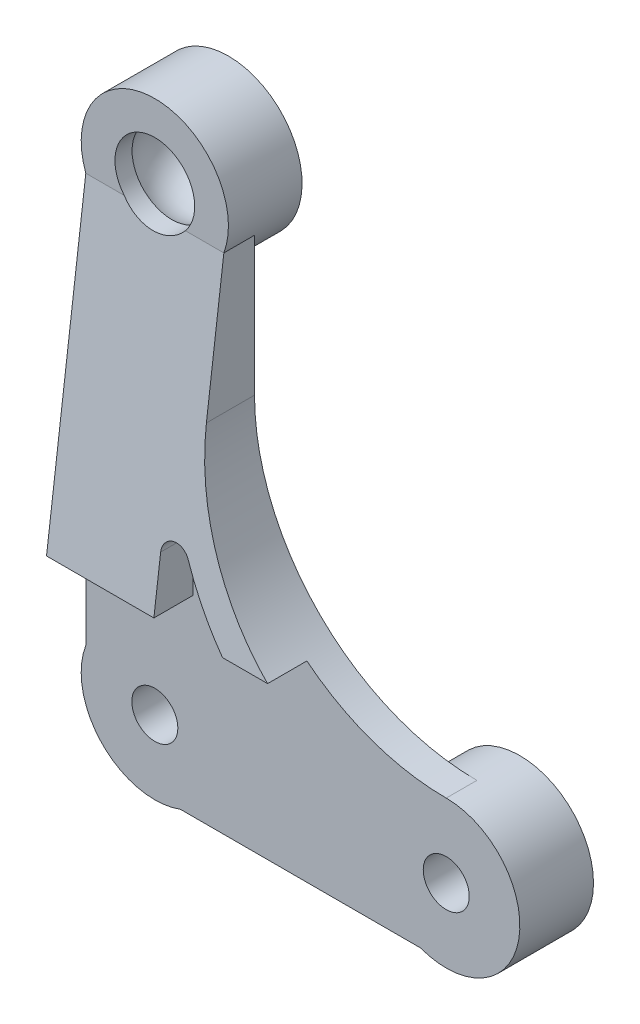
ISO-10303-21;
HEADER;
FILE_DESCRIPTION(('STEP AP214'),'2;1');
FILE_NAME('part.step','',(''),(''),'','','');
FILE_SCHEMA(('AUTOMOTIVE_DESIGN { 1 0 10303 214 1 1 1 1 }'));
ENDSEC;
DATA;
#1=APPLICATION_CONTEXT('core data for automotive mechanical design processes');
#2=APPLICATION_PROTOCOL_DEFINITION('international standard','automotive_design',2000,#1);
#3=PRODUCT_CONTEXT('',#1,'mechanical');
#4=PRODUCT('Part','Part','',(#3));
#5=PRODUCT_RELATED_PRODUCT_CATEGORY('part','',(#4));
#6=PRODUCT_DEFINITION_FORMATION('','',#4);
#7=PRODUCT_DEFINITION_CONTEXT('part definition',#1,'design');
#8=PRODUCT_DEFINITION('design','',#6,#7);
#9=PRODUCT_DEFINITION_SHAPE('','',#8);
#10=(LENGTH_UNIT() NAMED_UNIT(*) SI_UNIT(.MILLI.,.METRE.));
#11=(NAMED_UNIT(*) PLANE_ANGLE_UNIT() SI_UNIT($,.RADIAN.));
#12=(NAMED_UNIT(*) SI_UNIT($,.STERADIAN.) SOLID_ANGLE_UNIT());
#13=UNCERTAINTY_MEASURE_WITH_UNIT(LENGTH_MEASURE(1.E-05),#10,'distance_accuracy_value','');
#14=(GEOMETRIC_REPRESENTATION_CONTEXT(3) GLOBAL_UNCERTAINTY_ASSIGNED_CONTEXT((#13)) GLOBAL_UNIT_ASSIGNED_CONTEXT((#10,
#11,#12)) REPRESENTATION_CONTEXT('',''));
#15=CARTESIAN_POINT('',(0.,0.,0.));
#16=DIRECTION('',(0.,0.,1.));
#17=DIRECTION('',(1.,0.,0.));
#18=AXIS2_PLACEMENT_3D('',#15,#16,#17);
#19=CARTESIAN_POINT('',(0.,30.,2.));
#20=DIRECTION('',(0.,0.,-1.));
#21=DIRECTION('',(-1.,0.,0.));
#22=AXIS2_PLACEMENT_3D('',#19,#20,#21);
#23=CYLINDRICAL_SURFACE('',#22,2.6);
#24=CARTESIAN_POINT('',(0.,30.,-2.29999999999999));
#25=DIRECTION('',(0.,0.,-1.));
#26=DIRECTION('',(-1.,0.,0.));
#27=AXIS2_PLACEMENT_3D('',#24,#25,#26);
#28=CIRCLE('',#27,2.6);
#29=CARTESIAN_POINT('',(-2.6,30.,-2.29999999999999));
#30=VERTEX_POINT('',#29);
#31=EDGE_CURVE('E45',#30,#30,#28,.T.);
#32=ORIENTED_EDGE('',*,*,#31,.T.);
#33=EDGE_LOOP('',(#32));
#34=FACE_BOUND('',#33,.T.);
#35=CARTESIAN_POINT('',(0.,30.,-1.68452325786651));
#36=DIRECTION('',(0.,0.,1.));
#37=DIRECTION('',(1.,0.,0.));
#38=AXIS2_PLACEMENT_3D('',#35,#36,#37);
#39=CIRCLE('',#38,2.6);
#40=CARTESIAN_POINT('',(0.,32.6,-1.68452325786651));
#41=VERTEX_POINT('',#40);
#42=EDGE_CURVE('E444',#41,#41,#39,.F.);
#43=ORIENTED_EDGE('',*,*,#42,.F.);
#44=EDGE_LOOP('',(#43));
#45=FACE_BOUND('',#44,.T.);
#46=ADVANCED_FACE('F37',(#34,#45),#23,.F.);
#47=CARTESIAN_POINT('',(0.,0.,2.));
#48=DIRECTION('',(0.,0.,1.));
#49=DIRECTION('',(1.,0.,0.));
#50=AXIS2_PLACEMENT_3D('',#47,#48,#49);
#51=PLANE('',#50);
#52=DIRECTION('',(-1.,0.,0.));
#53=VECTOR('',#52,1.);
#54=CARTESIAN_POINT('',(0.,28.329670691151,2.));
#55=LINE('',#54,#53);
#56=CARTESIAN_POINT('',(-1.99248588451712,28.329670691151,2.));
#57=VERTEX_POINT('',#56);
#58=CARTESIAN_POINT('',(-4.5,28.329670691151,2.));
#59=VERTEX_POINT('',#58);
#60=EDGE_CURVE('E222',#57,#59,#55,.T.);
#61=ORIENTED_EDGE('',*,*,#60,.F.);
#62=CARTESIAN_POINT('',(0.,30.,2.));
#63=DIRECTION('',(0.,0.,1.));
#64=DIRECTION('',(1.,0.,0.));
#65=AXIS2_PLACEMENT_3D('',#62,#63,#64);
#66=CIRCLE('',#65,2.6);
#67=CARTESIAN_POINT('',(1.99248588451713,28.329670691151,2.));
#68=VERTEX_POINT('',#67);
#69=EDGE_CURVE('E381',#68,#57,#66,.T.);
#70=ORIENTED_EDGE('',*,*,#69,.F.);
#71=DIRECTION('',(-1.,0.,0.));
#72=VECTOR('',#71,1.);
#73=CARTESIAN_POINT('',(0.,28.329670691151,2.));
#74=LINE('',#73,#72);
#75=CARTESIAN_POINT('',(4.5,28.329670691151,2.));
#76=VERTEX_POINT('',#75);
#77=EDGE_CURVE('E441',#76,#68,#74,.T.);
#78=ORIENTED_EDGE('',*,*,#77,.F.);
#79=CARTESIAN_POINT('',(0.,30.,2.));
#80=DIRECTION('',(0.,0.,1.));
#81=DIRECTION('',(1.,0.,0.));
#82=AXIS2_PLACEMENT_3D('',#79,#80,#81);
#83=CIRCLE('',#82,4.8);
#84=EDGE_CURVE('E366',#76,#59,#83,.T.);
#85=ORIENTED_EDGE('',*,*,#84,.T.);
#86=EDGE_LOOP('',(#61,#70,#78,#85));
#87=FACE_BOUND('',#86,.T.);
#88=ADVANCED_FACE('F394',(#87),#51,.T.);
#89=CARTESIAN_POINT('',(0.,0.,0.));
#90=DIRECTION('',(0.,0.,1.));
#91=DIRECTION('',(1.,0.,0.));
#92=AXIS2_PLACEMENT_3D('',#89,#90,#91);
#93=PLANE('',#92);
#94=CARTESIAN_POINT('',(0.,0.,0.));
#95=DIRECTION('',(0.,0.,-1.));
#96=DIRECTION('',(-1.,0.,0.));
#97=AXIS2_PLACEMENT_3D('',#94,#95,#96);
#98=CIRCLE('',#97,4.8);
#99=CARTESIAN_POINT('',(4.5912961132996,-1.4,0.));
#100=VERTEX_POINT('',#99);
#101=CARTESIAN_POINT('',(1.67032930884901,-4.5,0.));
#102=VERTEX_POINT('',#101);
#103=EDGE_CURVE('E233',#100,#102,#98,.T.);
#104=ORIENTED_EDGE('',*,*,#103,.F.);
#105=DIRECTION('',(-1.,0.,0.));
#106=VECTOR('',#105,1.);
#107=CARTESIAN_POINT('',(14.4087038867004,-1.4,0.));
#108=LINE('',#107,#106);
#109=CARTESIAN_POINT('',(14.4087038867004,-1.4,0.));
#110=VERTEX_POINT('',#109);
#111=EDGE_CURVE('E238',#110,#100,#108,.T.);
#112=ORIENTED_EDGE('',*,*,#111,.F.);
#113=CARTESIAN_POINT('',(19.,0.,0.));
#114=DIRECTION('',(0.,0.,-1.));
#115=DIRECTION('',(-1.,0.,0.));
#116=AXIS2_PLACEMENT_3D('',#113,#114,#115);
#117=CIRCLE('',#116,4.8);
#118=CARTESIAN_POINT('',(17.329670691151,-4.5,0.));
#119=VERTEX_POINT('',#118);
#120=EDGE_CURVE('E334',#119,#110,#117,.T.);
#121=ORIENTED_EDGE('',*,*,#120,.F.);
#122=DIRECTION('',(1.,0.,0.));
#123=VECTOR('',#122,1.);
#124=CARTESIAN_POINT('',(0.,-4.5,0.));
#125=LINE('',#124,#123);
#126=EDGE_CURVE('E321',#102,#119,#125,.T.);
#127=ORIENTED_EDGE('',*,*,#126,.F.);
#128=EDGE_LOOP('',(#104,#112,#121,#127));
#129=FACE_BOUND('',#128,.T.);
#130=ADVANCED_FACE('F408',(#129),#93,.F.);
#131=CARTESIAN_POINT('',(14.4268684976693,1.45824149659455,0.));
#132=VERTEX_POINT('',#131);
#133=CARTESIAN_POINT('',(19.,4.8,0.));
#134=VERTEX_POINT('',#133);
#135=EDGE_CURVE('E266',#132,#134,#117,.T.);
#136=ORIENTED_EDGE('',*,*,#135,.F.);
#137=DIRECTION('',(0.999982468286778,0.00592141191639076,0.));
#138=VECTOR('',#137,1.);
#139=CARTESIAN_POINT('',(4.5912961132996,1.4,0.));
#140=LINE('',#139,#138);
#141=CARTESIAN_POINT('',(4.5912961132996,1.4,0.));
#142=VERTEX_POINT('',#141);
#143=EDGE_CURVE('E263',#142,#132,#140,.T.);
#144=ORIENTED_EDGE('',*,*,#143,.F.);
#145=CARTESIAN_POINT('',(0.,0.,0.));
#146=DIRECTION('',(0.,0.,-1.));
#147=DIRECTION('',(-1.,0.,0.));
#148=AXIS2_PLACEMENT_3D('',#145,#146,#147);
#149=CIRCLE('',#148,4.8);
#150=CARTESIAN_POINT('',(1.4,4.5912961132996,0.));
#151=VERTEX_POINT('',#150);
#152=EDGE_CURVE('E260',#151,#142,#149,.T.);
#153=ORIENTED_EDGE('',*,*,#152,.F.);
#154=DIRECTION('',(0.,-1.,0.));
#155=VECTOR('',#154,1.);
#156=CARTESIAN_POINT('',(1.4,25.4087038867004,0.));
#157=LINE('',#156,#155);
#158=CARTESIAN_POINT('',(1.4,25.4087038867004,0.));
#159=VERTEX_POINT('',#158);
#160=EDGE_CURVE('E257',#159,#151,#157,.T.);
#161=ORIENTED_EDGE('',*,*,#160,.F.);
#162=CARTESIAN_POINT('',(0.,30.,0.));
#163=DIRECTION('',(0.,0.,-1.));
#164=DIRECTION('',(-1.,0.,0.));
#165=AXIS2_PLACEMENT_3D('',#162,#163,#164);
#166=CIRCLE('',#165,4.8);
#167=CARTESIAN_POINT('',(4.5,28.329670691151,0.));
#168=VERTEX_POINT('',#167);
#169=EDGE_CURVE('E309',#168,#159,#166,.T.);
#170=ORIENTED_EDGE('',*,*,#169,.F.);
#171=DIRECTION('',(0.,1.,0.));
#172=VECTOR('',#171,1.);
#173=CARTESIAN_POINT('',(4.5,0.,0.));
#174=LINE('',#173,#172);
#175=CARTESIAN_POINT('',(4.5,19.3,0.));
#176=VERTEX_POINT('',#175);
#177=EDGE_CURVE('E322',#176,#168,#174,.T.);
#178=ORIENTED_EDGE('',*,*,#177,.F.);
#179=CARTESIAN_POINT('',(19.,19.3,0.));
#180=DIRECTION('',(0.,0.,1.));
#181=DIRECTION('',(1.,0.,0.));
#182=AXIS2_PLACEMENT_3D('',#179,#180,#181);
#183=CIRCLE('',#182,14.5);
#184=EDGE_CURVE('E292',#176,#134,#183,.T.);
#185=ORIENTED_EDGE('',*,*,#184,.T.);
#186=EDGE_LOOP('',(#136,#144,#153,#161,#170,#178,#185));
#187=FACE_BOUND('',#186,.T.);
#188=ADVANCED_FACE('F748',(#187),#93,.F.);
#189=CARTESIAN_POINT('',(-4.5,1.67032930884901,0.));
#190=VERTEX_POINT('',#189);
#191=CARTESIAN_POINT('',(-1.4,4.5912961132996,0.));
#192=VERTEX_POINT('',#191);
#193=EDGE_CURVE('E306',#190,#192,#98,.T.);
#194=ORIENTED_EDGE('',*,*,#193,.F.);
#195=DIRECTION('',(0.,1.,0.));
#196=VECTOR('',#195,1.);
#197=CARTESIAN_POINT('',(-4.5,0.,0.));
#198=LINE('',#197,#196);
#199=CARTESIAN_POINT('',(-4.5,28.329670691151,0.));
#200=VERTEX_POINT('',#199);
#201=EDGE_CURVE('E318',#190,#200,#198,.T.);
#202=ORIENTED_EDGE('',*,*,#201,.T.);
#203=CARTESIAN_POINT('',(-1.4,25.4087038867004,0.));
#204=VERTEX_POINT('',#203);
#205=EDGE_CURVE('E256',#204,#200,#166,.T.);
#206=ORIENTED_EDGE('',*,*,#205,.F.);
#207=DIRECTION('',(0.,1.,0.));
#208=VECTOR('',#207,1.);
#209=CARTESIAN_POINT('',(-1.4,4.5912961132996,0.));
#210=LINE('',#209,#208);
#211=EDGE_CURVE('E253',#192,#204,#210,.T.);
#212=ORIENTED_EDGE('',*,*,#211,.F.);
#213=EDGE_LOOP('',(#194,#202,#206,#212));
#214=FACE_BOUND('',#213,.T.);
#215=ADVANCED_FACE('F552',(#214),#93,.F.);
#216=CARTESIAN_POINT('',(19.,19.3,2.));
#217=DIRECTION('',(0.,0.,-1.));
#218=DIRECTION('',(-1.,0.,0.));
#219=AXIS2_PLACEMENT_3D('',#216,#217,#218);
#220=CYLINDRICAL_SURFACE('',#219,14.5);
#221=ORIENTED_EDGE('',*,*,#184,.F.);
#222=DIRECTION('',(0.,0.,-1.));
#223=VECTOR('',#222,1.);
#224=CARTESIAN_POINT('',(4.5,19.3,2.));
#225=LINE('',#224,#223);
#226=CARTESIAN_POINT('',(4.5,19.3,3.13751057506432));
#227=VERTEX_POINT('',#226);
#228=EDGE_CURVE('E300',#227,#176,#225,.T.);
#229=ORIENTED_EDGE('',*,*,#228,.F.);
#230=CARTESIAN_POINT('',(19.,19.3,3.13751057506432));
#231=DIRECTION('',(0.,0.124986912573693,0.992158390422263));
#232=DIRECTION('',(0.,0.992158390422263,-0.124986912573693));
#233=AXIS2_PLACEMENT_3D('',#230,#231,#232);
#234=ELLIPSE('',#233,14.6146020030419,14.5);
#235=CARTESIAN_POINT('',(9.91374664671957,8.,4.56102533411568));
#236=VERTEX_POINT('',#235);
#237=EDGE_CURVE('E458',#236,#227,#234,.F.);
#238=ORIENTED_EDGE('',*,*,#237,.F.);
#239=DIRECTION('',(0.,0.,-1.));
#240=VECTOR('',#239,1.);
#241=CARTESIAN_POINT('',(9.91374664671957,8.,28.2999018797489));
#242=LINE('',#241,#240);
#243=CARTESIAN_POINT('',(9.91374664671956,7.99999999999999,2.));
#244=VERTEX_POINT('',#243);
#245=EDGE_CURVE('E225',#236,#244,#242,.T.);
#246=ORIENTED_EDGE('',*,*,#245,.T.);
#247=CARTESIAN_POINT('',(19.,19.3,2.));
#248=DIRECTION('',(0.,0.,1.));
#249=DIRECTION('',(1.,0.,0.));
#250=AXIS2_PLACEMENT_3D('',#247,#248,#249);
#251=CIRCLE('',#250,14.5);
#252=CARTESIAN_POINT('',(19.,4.8,2.));
#253=VERTEX_POINT('',#252);
#254=EDGE_CURVE('E331',#244,#253,#251,.T.);
#255=ORIENTED_EDGE('',*,*,#254,.T.);
#256=DIRECTION('',(0.,0.,-1.));
#257=VECTOR('',#256,1.);
#258=CARTESIAN_POINT('',(19.,4.8,2.));
#259=LINE('',#258,#257);
#260=EDGE_CURVE('E339',#253,#134,#259,.T.);
#261=ORIENTED_EDGE('',*,*,#260,.T.);
#262=EDGE_LOOP('',(#221,#229,#238,#246,#255,#261));
#263=FACE_BOUND('',#262,.T.);
#264=ADVANCED_FACE('F688',(#263),#220,.F.);
#265=CARTESIAN_POINT('',(4.5,0.,2.));
#266=DIRECTION('',(-1.,0.,0.));
#267=DIRECTION('',(0.,-1.,0.));
#268=AXIS2_PLACEMENT_3D('',#265,#266,#267);
#269=PLANE('',#268);
#270=ORIENTED_EDGE('',*,*,#177,.T.);
#271=DIRECTION('',(0.,0.,-1.));
#272=VECTOR('',#271,1.);
#273=CARTESIAN_POINT('',(4.5,28.329670691151,2.));
#274=LINE('',#273,#272);
#275=EDGE_CURVE('E356',#76,#168,#274,.T.);
#276=ORIENTED_EDGE('',*,*,#275,.F.);
#277=DIRECTION('',(0.,0.992158390422263,-0.124986912573693));
#278=VECTOR('',#277,1.);
#279=CARTESIAN_POINT('',(4.5,-2.81880862191602,5.92392212603156));
#280=LINE('',#279,#278);
#281=EDGE_CURVE('E456',#227,#76,#280,.T.);
#282=ORIENTED_EDGE('',*,*,#281,.F.);
#283=ORIENTED_EDGE('',*,*,#228,.T.);
#284=EDGE_LOOP('',(#270,#276,#282,#283));
#285=FACE_BOUND('',#284,.T.);
#286=ADVANCED_FACE('F694',(#285),#269,.F.);
#287=CARTESIAN_POINT('',(0.,30.,2.));
#288=DIRECTION('',(0.,0.,-1.));
#289=DIRECTION('',(-1.,0.,0.));
#290=AXIS2_PLACEMENT_3D('',#287,#288,#289);
#291=CYLINDRICAL_SURFACE('',#290,4.8);
#292=ORIENTED_EDGE('',*,*,#275,.T.);
#293=ORIENTED_EDGE('',*,*,#169,.T.);
#294=DIRECTION('',(0.,0.,1.));
#295=VECTOR('',#294,1.);
#296=CARTESIAN_POINT('',(1.4,25.4087038867004,-2.8));
#297=LINE('',#296,#295);
#298=CARTESIAN_POINT('',(1.4,25.4087038867004,-2.8));
#299=VERTEX_POINT('',#298);
#300=EDGE_CURVE('E283',#299,#159,#297,.T.);
#301=ORIENTED_EDGE('',*,*,#300,.F.);
#302=CARTESIAN_POINT('',(0.,30.,-2.8));
#303=DIRECTION('',(0.,0.,-1.));
#304=DIRECTION('',(-1.,0.,0.));
#305=AXIS2_PLACEMENT_3D('',#302,#303,#304);
#306=CIRCLE('',#305,4.8);
#307=CARTESIAN_POINT('',(-1.4,25.4087038867004,-2.8));
#308=VERTEX_POINT('',#307);
#309=EDGE_CURVE('E240',#308,#299,#306,.T.);
#310=ORIENTED_EDGE('',*,*,#309,.F.);
#311=DIRECTION('',(0.,0.,1.));
#312=VECTOR('',#311,1.);
#313=CARTESIAN_POINT('',(-1.4,25.4087038867004,-2.8));
#314=LINE('',#313,#312);
#315=EDGE_CURVE('E286',#308,#204,#314,.T.);
#316=ORIENTED_EDGE('',*,*,#315,.T.);
#317=ORIENTED_EDGE('',*,*,#205,.T.);
#318=DIRECTION('',(0.,0.,-1.));
#319=VECTOR('',#318,1.);
#320=CARTESIAN_POINT('',(-4.5,28.329670691151,2.));
#321=LINE('',#320,#319);
#322=EDGE_CURVE('E314',#59,#200,#321,.T.);
#323=ORIENTED_EDGE('',*,*,#322,.F.);
#324=ORIENTED_EDGE('',*,*,#84,.F.);
#325=EDGE_LOOP('',(#292,#293,#301,#310,#316,#317,#323,#324));
#326=FACE_BOUND('',#325,.T.);
#327=ADVANCED_FACE('F517',(#326),#291,.T.);
#328=CARTESIAN_POINT('',(-4.5,0.,2.));
#329=DIRECTION('',(-1.,0.,0.));
#330=DIRECTION('',(0.,0.,1.));
#331=AXIS2_PLACEMENT_3D('',#328,#329,#330);
#332=PLANE('',#331);
#333=ORIENTED_EDGE('',*,*,#201,.F.);
#334=DIRECTION('',(0.,0.,-1.));
#335=VECTOR('',#334,1.);
#336=CARTESIAN_POINT('',(-4.5,1.67032930884901,2.));
#337=LINE('',#336,#335);
#338=CARTESIAN_POINT('',(-4.5,1.67032930884901,2.));
#339=VERTEX_POINT('',#338);
#340=EDGE_CURVE('E311',#339,#190,#337,.T.);
#341=ORIENTED_EDGE('',*,*,#340,.F.);
#342=DIRECTION('',(0.,1.,0.));
#343=VECTOR('',#342,1.);
#344=CARTESIAN_POINT('',(-4.5,0.,2.));
#345=LINE('',#344,#343);
#346=CARTESIAN_POINT('',(-4.5,8.,2.));
#347=VERTEX_POINT('',#346);
#348=EDGE_CURVE('E367',#339,#347,#345,.T.);
#349=ORIENTED_EDGE('',*,*,#348,.T.);
#350=DIRECTION('',(0.,0.,-1.));
#351=VECTOR('',#350,1.);
#352=CARTESIAN_POINT('',(-4.5,8.,28.2999018797489));
#353=LINE('',#352,#351);
#354=CARTESIAN_POINT('',(-4.5,8.,4.56102533411568));
#355=VERTEX_POINT('',#354);
#356=EDGE_CURVE('E468',#355,#347,#353,.T.);
#357=ORIENTED_EDGE('',*,*,#356,.F.);
#358=DIRECTION('',(0.,-0.992158390422263,0.124986912573693));
#359=VECTOR('',#358,1.);
#360=CARTESIAN_POINT('',(-4.5,-2.81880862191602,5.92392212603156));
#361=LINE('',#360,#359);
#362=EDGE_CURVE('E220',#59,#355,#361,.T.);
#363=ORIENTED_EDGE('',*,*,#362,.F.);
#364=ORIENTED_EDGE('',*,*,#322,.T.);
#365=EDGE_LOOP('',(#333,#341,#349,#357,#363,#364));
#366=FACE_BOUND('',#365,.T.);
#367=ADVANCED_FACE('F548',(#366),#332,.T.);
#368=CARTESIAN_POINT('',(0.,0.,2.));
#369=DIRECTION('',(0.,0.,-1.));
#370=DIRECTION('',(-1.,0.,0.));
#371=AXIS2_PLACEMENT_3D('',#368,#369,#370);
#372=CYLINDRICAL_SURFACE('',#371,4.8);
#373=ORIENTED_EDGE('',*,*,#340,.T.);
#374=ORIENTED_EDGE('',*,*,#193,.T.);
#375=DIRECTION('',(0.,0.,1.));
#376=VECTOR('',#375,1.);
#377=CARTESIAN_POINT('',(-1.4,4.5912961132996,-2.8));
#378=LINE('',#377,#376);
#379=CARTESIAN_POINT('',(-1.4,4.5912961132996,-2.8));
#380=VERTEX_POINT('',#379);
#381=EDGE_CURVE('E289',#380,#192,#378,.T.);
#382=ORIENTED_EDGE('',*,*,#381,.F.);
#383=CARTESIAN_POINT('',(0.,0.,-2.8));
#384=DIRECTION('',(0.,0.,-1.));
#385=DIRECTION('',(-1.,0.,0.));
#386=AXIS2_PLACEMENT_3D('',#383,#384,#385);
#387=CIRCLE('',#386,4.8);
#388=CARTESIAN_POINT('',(4.5912961132996,-1.4,-2.8));
#389=VERTEX_POINT('',#388);
#390=EDGE_CURVE('E234',#389,#380,#387,.T.);
#391=ORIENTED_EDGE('',*,*,#390,.F.);
#392=DIRECTION('',(0.,0.,1.));
#393=VECTOR('',#392,1.);
#394=CARTESIAN_POINT('',(4.5912961132996,-1.4,-2.8));
#395=LINE('',#394,#393);
#396=EDGE_CURVE('E252',#389,#100,#395,.T.);
#397=ORIENTED_EDGE('',*,*,#396,.T.);
#398=ORIENTED_EDGE('',*,*,#103,.T.);
#399=DIRECTION('',(0.,0.,-1.));
#400=VECTOR('',#399,1.);
#401=CARTESIAN_POINT('',(1.67032930884901,-4.5,2.));
#402=LINE('',#401,#400);
#403=CARTESIAN_POINT('',(1.67032930884901,-4.5,2.));
#404=VERTEX_POINT('',#403);
#405=EDGE_CURVE('E315',#404,#102,#402,.T.);
#406=ORIENTED_EDGE('',*,*,#405,.F.);
#407=CARTESIAN_POINT('',(0.,0.,2.));
#408=DIRECTION('',(0.,0.,1.));
#409=DIRECTION('',(1.,0.,0.));
#410=AXIS2_PLACEMENT_3D('',#407,#408,#409);
#411=CIRCLE('',#410,4.8);
#412=EDGE_CURVE('E374',#339,#404,#411,.T.);
#413=ORIENTED_EDGE('',*,*,#412,.F.);
#414=EDGE_LOOP('',(#373,#374,#382,#391,#397,#398,#406,#413));
#415=FACE_BOUND('',#414,.T.);
#416=ADVANCED_FACE('F511',(#415),#372,.T.);
#417=CARTESIAN_POINT('',(0.,-4.5,2.));
#418=DIRECTION('',(0.,1.,0.));
#419=DIRECTION('',(0.,0.,1.));
#420=AXIS2_PLACEMENT_3D('',#417,#418,#419);
#421=PLANE('',#420);
#422=ORIENTED_EDGE('',*,*,#126,.T.);
#423=DIRECTION('',(0.,0.,-1.));
#424=VECTOR('',#423,1.);
#425=CARTESIAN_POINT('',(17.329670691151,-4.5,2.));
#426=LINE('',#425,#424);
#427=CARTESIAN_POINT('',(17.329670691151,-4.5,2.));
#428=VERTEX_POINT('',#427);
#429=EDGE_CURVE('E326',#428,#119,#426,.T.);
#430=ORIENTED_EDGE('',*,*,#429,.F.);
#431=DIRECTION('',(1.,0.,0.));
#432=VECTOR('',#431,1.);
#433=CARTESIAN_POINT('',(0.,-4.5,2.));
#434=LINE('',#433,#432);
#435=EDGE_CURVE('E376',#404,#428,#434,.T.);
#436=ORIENTED_EDGE('',*,*,#435,.F.);
#437=ORIENTED_EDGE('',*,*,#405,.T.);
#438=EDGE_LOOP('',(#422,#430,#436,#437));
#439=FACE_BOUND('',#438,.T.);
#440=ADVANCED_FACE('F428',(#439),#421,.F.);
#441=CARTESIAN_POINT('',(19.,0.,2.));
#442=DIRECTION('',(0.,0.,-1.));
#443=DIRECTION('',(-1.,0.,0.));
#444=AXIS2_PLACEMENT_3D('',#441,#442,#443);
#445=CYLINDRICAL_SURFACE('',#444,1.5);
#446=CARTESIAN_POINT('',(19.,0.,2.));
#447=DIRECTION('',(0.,0.,1.));
#448=DIRECTION('',(1.,0.,0.));
#449=AXIS2_PLACEMENT_3D('',#446,#447,#448);
#450=CIRCLE('',#449,1.5);
#451=CARTESIAN_POINT('',(20.5,0.,2.));
#452=VERTEX_POINT('',#451);
#453=EDGE_CURVE('E382',#452,#452,#450,.T.);
#454=ORIENTED_EDGE('',*,*,#453,.T.);
#455=EDGE_LOOP('',(#454));
#456=FACE_BOUND('',#455,.T.);
#457=CARTESIAN_POINT('',(19.,0.,-2.8));
#458=DIRECTION('',(0.,0.,-1.));
#459=DIRECTION('',(-1.,0.,0.));
#460=AXIS2_PLACEMENT_3D('',#457,#458,#459);
#461=CIRCLE('',#460,1.5);
#462=CARTESIAN_POINT('',(17.5,0.,-2.8));
#463=VERTEX_POINT('',#462);
#464=EDGE_CURVE('E212',#463,#463,#461,.T.);
#465=ORIENTED_EDGE('',*,*,#464,.T.);
#466=EDGE_LOOP('',(#465));
#467=FACE_BOUND('',#466,.T.);
#468=ADVANCED_FACE('F421',(#456,#467),#445,.F.);
#469=CARTESIAN_POINT('',(0.,30.,0.884523257866508));
#470=DIRECTION('',(0.,0.,-1.));
#471=DIRECTION('',(-1.,0.,0.));
#472=AXIS2_PLACEMENT_3D('',#469,#470,#471);
#473=CIRCLE('',#472,2.6);
#474=CARTESIAN_POINT('',(0.,32.6,0.884523257866508));
#475=VERTEX_POINT('',#474);
#476=EDGE_CURVE('E433',#475,#475,#473,.F.);
#477=ORIENTED_EDGE('',*,*,#476,.F.);
#478=EDGE_LOOP('',(#477));
#479=FACE_BOUND('',#478,.T.);
#480=ORIENTED_EDGE('',*,*,#69,.T.);
#481=CARTESIAN_POINT('',(0.,30.,1.78958067047587));
#482=DIRECTION('',(0.,0.124986912573693,0.992158390422263));
#483=DIRECTION('',(0.,0.992158390422263,-0.124986912573693));
#484=AXIS2_PLACEMENT_3D('',#481,#482,#483);
#485=ELLIPSE('',#484,2.62054932468337,2.6);
#486=EDGE_CURVE('E437',#68,#57,#485,.F.);
#487=ORIENTED_EDGE('',*,*,#486,.F.);
#488=EDGE_LOOP('',(#480,#487));
#489=FACE_BOUND('',#488,.T.);
#490=ADVANCED_FACE('F413',(#479,#489),#23,.F.);
#491=CARTESIAN_POINT('',(19.,0.,2.));
#492=DIRECTION('',(0.,0.,-1.));
#493=DIRECTION('',(-1.,0.,0.));
#494=AXIS2_PLACEMENT_3D('',#491,#492,#493);
#495=CYLINDRICAL_SURFACE('',#494,4.8);
#496=ORIENTED_EDGE('',*,*,#429,.T.);
#497=ORIENTED_EDGE('',*,*,#120,.T.);
#498=DIRECTION('',(0.,0.,1.));
#499=VECTOR('',#498,1.);
#500=CARTESIAN_POINT('',(14.4087038867004,-1.4,-2.8));
#501=LINE('',#500,#499);
#502=CARTESIAN_POINT('',(14.4087038867004,-1.4,-2.8));
#503=VERTEX_POINT('',#502);
#504=EDGE_CURVE('E271',#503,#110,#501,.T.);
#505=ORIENTED_EDGE('',*,*,#504,.F.);
#506=CARTESIAN_POINT('',(19.,0.,-2.8));
#507=DIRECTION('',(0.,0.,-1.));
#508=DIRECTION('',(-1.,0.,0.));
#509=AXIS2_PLACEMENT_3D('',#506,#507,#508);
#510=CIRCLE('',#509,4.8);
#511=CARTESIAN_POINT('',(14.4268684976693,1.45824149659455,-2.8));
#512=VERTEX_POINT('',#511);
#513=EDGE_CURVE('E248',#512,#503,#510,.T.);
#514=ORIENTED_EDGE('',*,*,#513,.F.);
#515=DIRECTION('',(0.,0.,1.));
#516=VECTOR('',#515,1.);
#517=CARTESIAN_POINT('',(14.4268684976693,1.45824149659455,-2.8));
#518=LINE('',#517,#516);
#519=EDGE_CURVE('E274',#512,#132,#518,.T.);
#520=ORIENTED_EDGE('',*,*,#519,.T.);
#521=ORIENTED_EDGE('',*,*,#135,.T.);
#522=ORIENTED_EDGE('',*,*,#260,.F.);
#523=CARTESIAN_POINT('',(19.,0.,2.));
#524=DIRECTION('',(0.,0.,1.));
#525=DIRECTION('',(1.,0.,0.));
#526=AXIS2_PLACEMENT_3D('',#523,#524,#525);
#527=CIRCLE('',#526,4.8);
#528=EDGE_CURVE('E378',#428,#253,#527,.T.);
#529=ORIENTED_EDGE('',*,*,#528,.F.);
#530=EDGE_LOOP('',(#496,#497,#505,#514,#520,#521,#522,#529));
#531=FACE_BOUND('',#530,.T.);
#532=ADVANCED_FACE('F402',(#531),#495,.T.);
#533=CARTESIAN_POINT('',(0.,0.,2.));
#534=DIRECTION('',(0.,0.,-1.));
#535=DIRECTION('',(-1.,0.,0.));
#536=AXIS2_PLACEMENT_3D('',#533,#534,#535);
#537=CYLINDRICAL_SURFACE('',#536,1.5);
#538=CARTESIAN_POINT('',(0.,0.,2.));
#539=DIRECTION('',(0.,0.,1.));
#540=DIRECTION('',(1.,0.,0.));
#541=AXIS2_PLACEMENT_3D('',#538,#539,#540);
#542=CIRCLE('',#541,1.5);
#543=CARTESIAN_POINT('',(1.5,0.,2.));
#544=VERTEX_POINT('',#543);
#545=EDGE_CURVE('E343',#544,#544,#542,.T.);
#546=ORIENTED_EDGE('',*,*,#545,.T.);
#547=EDGE_LOOP('',(#546));
#548=FACE_BOUND('',#547,.T.);
#549=CARTESIAN_POINT('',(0.,0.,-2.8));
#550=DIRECTION('',(0.,0.,-1.));
#551=DIRECTION('',(-1.,0.,0.));
#552=AXIS2_PLACEMENT_3D('',#549,#550,#551);
#553=CIRCLE('',#552,1.5);
#554=CARTESIAN_POINT('',(-1.5,0.,-2.8));
#555=VERTEX_POINT('',#554);
#556=EDGE_CURVE('E230',#555,#555,#553,.T.);
#557=ORIENTED_EDGE('',*,*,#556,.T.);
#558=EDGE_LOOP('',(#557));
#559=FACE_BOUND('',#558,.T.);
#560=ADVANCED_FACE('F387',(#548,#559),#537,.F.);
#561=DIRECTION('',(1.,0.,0.));
#562=VECTOR('',#561,1.);
#563=CARTESIAN_POINT('',(0.,8.,2.));
#564=LINE('',#563,#562);
#565=CARTESIAN_POINT('',(2.5,8.,2.));
#566=VERTEX_POINT('',#565);
#567=EDGE_CURVE('E466',#347,#566,#564,.T.);
#568=ORIENTED_EDGE('',*,*,#567,.F.);
#569=ORIENTED_EDGE('',*,*,#348,.F.);
#570=ORIENTED_EDGE('',*,*,#412,.T.);
#571=ORIENTED_EDGE('',*,*,#435,.T.);
#572=ORIENTED_EDGE('',*,*,#528,.T.);
#573=ORIENTED_EDGE('',*,*,#254,.F.);
#574=DIRECTION('',(1.,0.,0.));
#575=VECTOR('',#574,1.);
#576=CARTESIAN_POINT('',(0.,7.99999999999998,2.));
#577=LINE('',#576,#575);
#578=CARTESIAN_POINT('',(6.97668930784869,7.99999999999999,2.));
#579=VERTEX_POINT('',#578);
#580=EDGE_CURVE('E204',#579,#244,#577,.T.);
#581=ORIENTED_EDGE('',*,*,#580,.F.);
#582=CARTESIAN_POINT('',(19.,19.3,2.));
#583=DIRECTION('',(0.,0.,1.));
#584=DIRECTION('',(1.,0.,0.));
#585=AXIS2_PLACEMENT_3D('',#582,#583,#584);
#586=CIRCLE('',#585,16.5);
#587=CARTESIAN_POINT('',(4.24608641202254,11.9127113337508,2.));
#588=VERTEX_POINT('',#587);
#589=EDGE_CURVE('E203',#588,#579,#586,.T.);
#590=ORIENTED_EDGE('',*,*,#589,.F.);
#591=CARTESIAN_POINT('',(3.42181818181818,11.5,2.));
#592=DIRECTION('',(0.,0.,1.));
#593=DIRECTION('',(1.,0.,0.));
#594=AXIS2_PLACEMENT_3D('',#591,#592,#593);
#595=CIRCLE('',#594,0.921818181818182);
#596=CARTESIAN_POINT('',(2.5,11.5,2.));
#597=VERTEX_POINT('',#596);
#598=EDGE_CURVE('E57',#588,#597,#595,.T.);
#599=ORIENTED_EDGE('',*,*,#598,.T.);
#600=DIRECTION('',(0.,1.,0.));
#601=VECTOR('',#600,1.);
#602=CARTESIAN_POINT('',(2.5,0.,2.));
#603=LINE('',#602,#601);
#604=EDGE_CURVE('E52',#566,#597,#603,.T.);
#605=ORIENTED_EDGE('',*,*,#604,.F.);
#606=EDGE_LOOP('',(#568,#569,#570,#571,#572,#573,#581,#590,#599,#605));
#607=FACE_BOUND('',#606,.T.);
#608=ORIENTED_EDGE('',*,*,#453,.F.);
#609=EDGE_LOOP('',(#608));
#610=FACE_BOUND('',#609,.T.);
#611=ORIENTED_EDGE('',*,*,#545,.F.);
#612=EDGE_LOOP('',(#611));
#613=FACE_BOUND('',#612,.T.);
#614=ADVANCED_FACE('F390',(#607,#610,#613),#51,.T.);
#615=CARTESIAN_POINT('',(0.,0.,-2.8));
#616=DIRECTION('',(0.,0.,-1.));
#617=DIRECTION('',(-1.,0.,0.));
#618=AXIS2_PLACEMENT_3D('',#615,#616,#617);
#619=PLANE('',#618);
#620=CARTESIAN_POINT('',(0.,30.,-2.8));
#621=DIRECTION('',(0.,0.,-1.));
#622=DIRECTION('',(-1.,0.,0.));
#623=AXIS2_PLACEMENT_3D('',#620,#621,#622);
#624=CIRCLE('',#623,3.1);
#625=CARTESIAN_POINT('',(-3.1,30.,-2.8));
#626=VERTEX_POINT('',#625);
#627=EDGE_CURVE('E11',#626,#626,#624,.F.);
#628=ORIENTED_EDGE('',*,*,#627,.T.);
#629=EDGE_LOOP('',(#628));
#630=FACE_BOUND('',#629,.T.);
#631=ORIENTED_EDGE('',*,*,#464,.F.);
#632=EDGE_LOOP('',(#631));
#633=FACE_BOUND('',#632,.T.);
#634=ORIENTED_EDGE('',*,*,#390,.T.);
#635=DIRECTION('',(0.,1.,0.));
#636=VECTOR('',#635,1.);
#637=CARTESIAN_POINT('',(-1.4,4.5912961132996,-2.8));
#638=LINE('',#637,#636);
#639=EDGE_CURVE('E237',#380,#308,#638,.T.);
#640=ORIENTED_EDGE('',*,*,#639,.T.);
#641=ORIENTED_EDGE('',*,*,#309,.T.);
#642=DIRECTION('',(0.,-1.,0.));
#643=VECTOR('',#642,1.);
#644=CARTESIAN_POINT('',(1.4,25.4087038867004,-2.8));
#645=LINE('',#644,#643);
#646=CARTESIAN_POINT('',(1.4,4.5912961132996,-2.8));
#647=VERTEX_POINT('',#646);
#648=EDGE_CURVE('E242',#299,#647,#645,.T.);
#649=ORIENTED_EDGE('',*,*,#648,.T.);
#650=CARTESIAN_POINT('',(0.,0.,-2.8));
#651=DIRECTION('',(0.,0.,-1.));
#652=DIRECTION('',(-1.,0.,0.));
#653=AXIS2_PLACEMENT_3D('',#650,#651,#652);
#654=CIRCLE('',#653,4.8);
#655=CARTESIAN_POINT('',(4.5912961132996,1.4,-2.8));
#656=VERTEX_POINT('',#655);
#657=EDGE_CURVE('E244',#647,#656,#654,.T.);
#658=ORIENTED_EDGE('',*,*,#657,.T.);
#659=DIRECTION('',(0.999982468286778,0.00592141191639076,0.));
#660=VECTOR('',#659,1.);
#661=CARTESIAN_POINT('',(4.5912961132996,1.4,-2.8));
#662=LINE('',#661,#660);
#663=EDGE_CURVE('E246',#656,#512,#662,.T.);
#664=ORIENTED_EDGE('',*,*,#663,.T.);
#665=ORIENTED_EDGE('',*,*,#513,.T.);
#666=DIRECTION('',(-1.,0.,0.));
#667=VECTOR('',#666,1.);
#668=CARTESIAN_POINT('',(14.4087038867004,-1.4,-2.8));
#669=LINE('',#668,#667);
#670=EDGE_CURVE('E250',#503,#389,#669,.T.);
#671=ORIENTED_EDGE('',*,*,#670,.T.);
#672=EDGE_LOOP('',(#634,#640,#641,#649,#658,#664,#665,#671));
#673=FACE_BOUND('',#672,.T.);
#674=ORIENTED_EDGE('',*,*,#556,.F.);
#675=EDGE_LOOP('',(#674));
#676=FACE_BOUND('',#675,.T.);
#677=ADVANCED_FACE('F392',(#630,#633,#673,#676),#619,.T.);
#678=CARTESIAN_POINT('',(-1.4,4.5912961132996,-2.8));
#679=DIRECTION('',(1.,0.,0.));
#680=DIRECTION('',(0.,1.,0.));
#681=AXIS2_PLACEMENT_3D('',#678,#679,#680);
#682=PLANE('',#681);
#683=ORIENTED_EDGE('',*,*,#211,.T.);
#684=ORIENTED_EDGE('',*,*,#315,.F.);
#685=ORIENTED_EDGE('',*,*,#639,.F.);
#686=ORIENTED_EDGE('',*,*,#381,.T.);
#687=EDGE_LOOP('',(#683,#684,#685,#686));
#688=FACE_BOUND('',#687,.T.);
#689=ADVANCED_FACE('F399',(#688),#682,.F.);
#690=CARTESIAN_POINT('',(1.4,25.4087038867004,-2.8));
#691=DIRECTION('',(-1.,0.,0.));
#692=DIRECTION('',(0.,-1.,0.));
#693=AXIS2_PLACEMENT_3D('',#690,#691,#692);
#694=PLANE('',#693);
#695=ORIENTED_EDGE('',*,*,#160,.T.);
#696=DIRECTION('',(0.,0.,1.));
#697=VECTOR('',#696,1.);
#698=CARTESIAN_POINT('',(1.4,4.5912961132996,-2.8));
#699=LINE('',#698,#697);
#700=EDGE_CURVE('E280',#647,#151,#699,.T.);
#701=ORIENTED_EDGE('',*,*,#700,.F.);
#702=ORIENTED_EDGE('',*,*,#648,.F.);
#703=ORIENTED_EDGE('',*,*,#300,.T.);
#704=EDGE_LOOP('',(#695,#701,#702,#703));
#705=FACE_BOUND('',#704,.T.);
#706=ADVANCED_FACE('F523',(#705),#694,.F.);
#707=CARTESIAN_POINT('',(0.,0.,-2.8));
#708=DIRECTION('',(0.,0.,1.));
#709=DIRECTION('',(1.,0.,0.));
#710=AXIS2_PLACEMENT_3D('',#707,#708,#709);
#711=CYLINDRICAL_SURFACE('',#710,4.8);
#712=ORIENTED_EDGE('',*,*,#152,.T.);
#713=DIRECTION('',(0.,0.,1.));
#714=VECTOR('',#713,1.);
#715=CARTESIAN_POINT('',(4.5912961132996,1.4,-2.8));
#716=LINE('',#715,#714);
#717=EDGE_CURVE('E277',#656,#142,#716,.T.);
#718=ORIENTED_EDGE('',*,*,#717,.F.);
#719=ORIENTED_EDGE('',*,*,#657,.F.);
#720=ORIENTED_EDGE('',*,*,#700,.T.);
#721=EDGE_LOOP('',(#712,#718,#719,#720));
#722=FACE_BOUND('',#721,.T.);
#723=ADVANCED_FACE('F525',(#722),#711,.T.);
#724=CARTESIAN_POINT('',(4.5912961132996,1.4,-2.8));
#725=DIRECTION('',(0.00592141191639076,-0.999982468286778,0.));
#726=DIRECTION('',(0.999982468286778,0.00592141191639076,0.));
#727=AXIS2_PLACEMENT_3D('',#724,#725,#726);
#728=PLANE('',#727);
#729=ORIENTED_EDGE('',*,*,#143,.T.);
#730=ORIENTED_EDGE('',*,*,#519,.F.);
#731=ORIENTED_EDGE('',*,*,#663,.F.);
#732=ORIENTED_EDGE('',*,*,#717,.T.);
#733=EDGE_LOOP('',(#729,#730,#731,#732));
#734=FACE_BOUND('',#733,.T.);
#735=ADVANCED_FACE('F529',(#734),#728,.F.);
#736=CARTESIAN_POINT('',(14.4087038867004,-1.4,-2.8));
#737=DIRECTION('',(0.,1.,0.));
#738=DIRECTION('',(-1.,0.,0.));
#739=AXIS2_PLACEMENT_3D('',#736,#737,#738);
#740=PLANE('',#739);
#741=ORIENTED_EDGE('',*,*,#111,.T.);
#742=ORIENTED_EDGE('',*,*,#396,.F.);
#743=ORIENTED_EDGE('',*,*,#670,.F.);
#744=ORIENTED_EDGE('',*,*,#504,.T.);
#745=EDGE_LOOP('',(#741,#742,#743,#744));
#746=FACE_BOUND('',#745,.T.);
#747=ADVANCED_FACE('F533',(#746),#740,.F.);
#748=CARTESIAN_POINT('',(0.,0.690572046788117,5.48182874753335));
#749=DIRECTION('',(0.,0.124986912573693,0.992158390422263));
#750=DIRECTION('',(0.,-0.992158390422263,0.124986912573693));
#751=AXIS2_PLACEMENT_3D('',#748,#749,#750);
#752=PLANE('',#751);
#753=ORIENTED_EDGE('',*,*,#77,.T.);
#754=ORIENTED_EDGE('',*,*,#486,.T.);
#755=ORIENTED_EDGE('',*,*,#60,.T.);
#756=ORIENTED_EDGE('',*,*,#362,.T.);
#757=DIRECTION('',(1.,0.,0.));
#758=VECTOR('',#757,1.);
#759=CARTESIAN_POINT('',(0.,8.,4.56102533411568));
#760=LINE('',#759,#758);
#761=CARTESIAN_POINT('',(2.5,8.,4.56102533411568));
#762=VERTEX_POINT('',#761);
#763=EDGE_CURVE('E218',#355,#762,#760,.T.);
#764=ORIENTED_EDGE('',*,*,#763,.T.);
#765=DIRECTION('',(0.,0.992158390422263,-0.124986912573693));
#766=VECTOR('',#765,1.);
#767=CARTESIAN_POINT('',(2.50000000000001,-2.81880862191601,5.92392212603156));
#768=LINE('',#767,#766);
#769=CARTESIAN_POINT('',(2.5,11.5,4.12011368308207));
#770=VERTEX_POINT('',#769);
#771=EDGE_CURVE('E197',#762,#770,#768,.T.);
#772=ORIENTED_EDGE('',*,*,#771,.T.);
#773=CARTESIAN_POINT('',(3.42181818181818,11.5,4.12011368308207));
#774=DIRECTION('',(0.,0.124986912573693,0.992158390422263));
#775=DIRECTION('',(0.,0.992158390422263,-0.124986912573693));
#776=AXIS2_PLACEMENT_3D('',#773,#774,#775);
#777=ELLIPSE('',#776,0.929103851478649,0.921818181818182);
#778=CARTESIAN_POINT('',(4.24608641202254,11.9127113337508,4.06812247292083));
#779=VERTEX_POINT('',#778);
#780=EDGE_CURVE('E201',#779,#770,#777,.T.);
#781=ORIENTED_EDGE('',*,*,#780,.F.);
#782=CARTESIAN_POINT('',(19.,19.3,3.13751057506432));
#783=DIRECTION('',(0.,0.124986912573693,0.992158390422263));
#784=DIRECTION('',(0.,0.992158390422263,-0.124986912573693));
#785=AXIS2_PLACEMENT_3D('',#782,#783,#784);
#786=ELLIPSE('',#785,16.6304091758752,16.5);
#787=CARTESIAN_POINT('',(6.97668930784869,7.99999999999999,4.56102533411568));
#788=VERTEX_POINT('',#787);
#789=EDGE_CURVE('E186',#779,#788,#786,.T.);
#790=ORIENTED_EDGE('',*,*,#789,.T.);
#791=DIRECTION('',(1.,0.,0.));
#792=VECTOR('',#791,1.);
#793=CARTESIAN_POINT('',(0.,7.99999999999998,4.56102533411568));
#794=LINE('',#793,#792);
#795=EDGE_CURVE('E196',#788,#236,#794,.T.);
#796=ORIENTED_EDGE('',*,*,#795,.T.);
#797=ORIENTED_EDGE('',*,*,#237,.T.);
#798=ORIENTED_EDGE('',*,*,#281,.T.);
#799=EDGE_LOOP('',(#753,#754,#755,#756,#764,#772,#781,#790,#796,#797,#798));
#800=FACE_BOUND('',#799,.T.);
#801=ADVANCED_FACE('F208',(#800),#752,.T.);
#802=CARTESIAN_POINT('',(2.5,0.,28.2999018797489));
#803=DIRECTION('',(-1.,0.,0.));
#804=DIRECTION('',(0.,-1.,0.));
#805=AXIS2_PLACEMENT_3D('',#802,#803,#804);
#806=PLANE('',#805);
#807=ORIENTED_EDGE('',*,*,#771,.F.);
#808=DIRECTION('',(0.,0.,-1.));
#809=VECTOR('',#808,1.);
#810=CARTESIAN_POINT('',(2.5,8.,28.2999018797489));
#811=LINE('',#810,#809);
#812=EDGE_CURVE('E226',#762,#566,#811,.T.);
#813=ORIENTED_EDGE('',*,*,#812,.T.);
#814=ORIENTED_EDGE('',*,*,#604,.T.);
#815=DIRECTION('',(0.,0.,-1.));
#816=VECTOR('',#815,1.);
#817=CARTESIAN_POINT('',(2.5,11.5,28.2999018797489));
#818=LINE('',#817,#816);
#819=EDGE_CURVE('E210',#770,#597,#818,.T.);
#820=ORIENTED_EDGE('',*,*,#819,.F.);
#821=EDGE_LOOP('',(#807,#813,#814,#820));
#822=FACE_BOUND('',#821,.T.);
#823=ADVANCED_FACE('F555',(#822),#806,.F.);
#824=CARTESIAN_POINT('',(0.,8.,28.2999018797489));
#825=DIRECTION('',(0.,1.,0.));
#826=DIRECTION('',(0.,0.,1.));
#827=AXIS2_PLACEMENT_3D('',#824,#825,#826);
#828=PLANE('',#827);
#829=ORIENTED_EDGE('',*,*,#763,.F.);
#830=ORIENTED_EDGE('',*,*,#356,.T.);
#831=ORIENTED_EDGE('',*,*,#567,.T.);
#832=ORIENTED_EDGE('',*,*,#812,.F.);
#833=EDGE_LOOP('',(#829,#830,#831,#832));
#834=FACE_BOUND('',#833,.T.);
#835=ADVANCED_FACE('F554',(#834),#828,.F.);
#836=CARTESIAN_POINT('',(0.,7.99999999999998,28.2999018797489));
#837=DIRECTION('',(0.,1.,0.));
#838=DIRECTION('',(-1.,0.,0.));
#839=AXIS2_PLACEMENT_3D('',#836,#837,#838);
#840=PLANE('',#839);
#841=ORIENTED_EDGE('',*,*,#795,.F.);
#842=DIRECTION('',(0.,0.,-1.));
#843=VECTOR('',#842,1.);
#844=CARTESIAN_POINT('',(6.97668930784869,7.99999999999999,28.2999018797489));
#845=LINE('',#844,#843);
#846=EDGE_CURVE('E192',#788,#579,#845,.T.);
#847=ORIENTED_EDGE('',*,*,#846,.T.);
#848=ORIENTED_EDGE('',*,*,#580,.T.);
#849=ORIENTED_EDGE('',*,*,#245,.F.);
#850=EDGE_LOOP('',(#841,#847,#848,#849));
#851=FACE_BOUND('',#850,.T.);
#852=ADVANCED_FACE('F462',(#851),#840,.F.);
#853=CARTESIAN_POINT('',(19.,19.3,28.2999018797489));
#854=DIRECTION('',(0.,0.,-1.));
#855=DIRECTION('',(-1.,0.,0.));
#856=AXIS2_PLACEMENT_3D('',#853,#854,#855);
#857=CYLINDRICAL_SURFACE('',#856,16.5);
#858=ORIENTED_EDGE('',*,*,#789,.F.);
#859=DIRECTION('',(0.,0.,-1.));
#860=VECTOR('',#859,1.);
#861=CARTESIAN_POINT('',(4.24608641202254,11.9127113337508,28.2999018797489));
#862=LINE('',#861,#860);
#863=EDGE_CURVE('E190',#779,#588,#862,.T.);
#864=ORIENTED_EDGE('',*,*,#863,.T.);
#865=ORIENTED_EDGE('',*,*,#589,.T.);
#866=ORIENTED_EDGE('',*,*,#846,.F.);
#867=EDGE_LOOP('',(#858,#864,#865,#866));
#868=FACE_BOUND('',#867,.T.);
#869=ADVANCED_FACE('F188',(#868),#857,.T.);
#870=CARTESIAN_POINT('',(3.42181818181818,11.5,28.2999018797489));
#871=DIRECTION('',(0.,0.,-1.));
#872=DIRECTION('',(-1.,0.,0.));
#873=AXIS2_PLACEMENT_3D('',#870,#871,#872);
#874=CYLINDRICAL_SURFACE('',#873,0.921818181818182);
#875=ORIENTED_EDGE('',*,*,#863,.F.);
#876=ORIENTED_EDGE('',*,*,#780,.T.);
#877=ORIENTED_EDGE('',*,*,#819,.T.);
#878=ORIENTED_EDGE('',*,*,#598,.F.);
#879=EDGE_LOOP('',(#875,#876,#877,#878));
#880=FACE_BOUND('',#879,.T.);
#881=ADVANCED_FACE('F200',(#880),#874,.F.);
#882=CARTESIAN_POINT('',(0.,30.,-0.400000000000001));
#883=DIRECTION('',(0.,0.,-1.));
#884=DIRECTION('',(0.,1.,0.));
#885=AXIS2_PLACEMENT_3D('',#882,#883,#884);
#886=SPHERICAL_SURFACE('',#885,2.9);
#887=CARTESIAN_POINT('',(0.,32.6,-1.68452325786651));
#888=CARTESIAN_POINT('',(0.,32.6122799939498,-1.65966762082869));
#889=CARTESIAN_POINT('',(0.,32.6242033525693,-1.63463579553613));
#890=CARTESIAN_POINT('',(0.,32.647327461325,-1.58424057132579));
#891=CARTESIAN_POINT('',(0.,32.6585282114613,-1.55887717240801));
#892=CARTESIAN_POINT('',(0.,32.6801977654282,-1.50783960383146));
#893=CARTESIAN_POINT('',(0.,32.6906665692589,-1.48216543417271));
#894=CARTESIAN_POINT('',(0.,32.7108636540403,-1.43052745566842));
#895=CARTESIAN_POINT('',(0.,32.720591934991,-1.4045636468229));
#896=CARTESIAN_POINT('',(0.,32.7392999638223,-1.35236774013794));
#897=CARTESIAN_POINT('',(0.,32.7482797117028,-1.3261356422985));
#898=CARTESIAN_POINT('',(0.,32.7654832912792,-1.27342473372323));
#899=CARTESIAN_POINT('',(0.,32.773707122975,-1.24694592298741));
#900=CARTESIAN_POINT('',(0.,32.7893921057189,-1.19376336622395));
#901=CARTESIAN_POINT('',(0.,32.796853256767,-1.16705962019632));
#902=CARTESIAN_POINT('',(0.,32.8110067418513,-1.11344915583195));
#903=CARTESIAN_POINT('',(0.,32.8176990758876,-1.08654243749521));
#904=CARTESIAN_POINT('',(0.,32.8303094226896,-1.03254815833208));
#905=CARTESIAN_POINT('',(0.,32.8362274354554,-1.00546059750568));
#906=CARTESIAN_POINT('',(0.,32.8472842723692,-0.951126911946378));
#907=CARTESIAN_POINT('',(0.,32.8524230965172,-0.923880787213473));
#908=CARTESIAN_POINT('',(0.,32.8619173296876,-0.869252382830364));
#909=CARTESIAN_POINT('',(0.,32.8662727387102,-0.84187010318016));
#910=CARTESIAN_POINT('',(0.,32.8741965594581,-0.786991909936292));
#911=CARTESIAN_POINT('',(0.,32.8777649711835,-0.759495996342628));
#912=CARTESIAN_POINT('',(0.,32.8841118624423,-0.704413149645127));
#913=CARTESIAN_POINT('',(0.,32.8868903419757,-0.676826216541289));
#914=CARTESIAN_POINT('',(0.,32.8916550836478,-0.621584020117252));
#915=CARTESIAN_POINT('',(0.,32.8936413457864,-0.593928756797053));
#916=CARTESIAN_POINT('',(0.,32.8968200190372,-0.538572645433293));
#917=CARTESIAN_POINT('',(0.,32.8980124301495,-0.510871797389733));
#918=CARTESIAN_POINT('',(0.,32.8996024206308,-0.455447299564116));
#919=CARTESIAN_POINT('',(0.,32.9,-0.427723649782058));
#920=CARTESIAN_POINT('',(0.,32.9,-0.372276350217943));
#921=CARTESIAN_POINT('',(0.,32.8996024206308,-0.344552700435885));
#922=CARTESIAN_POINT('',(0.,32.8980124301495,-0.289128202610268));
#923=CARTESIAN_POINT('',(0.,32.8968200190372,-0.261427354566708));
#924=CARTESIAN_POINT('',(0.,32.8936413457864,-0.206071243202948));
#925=CARTESIAN_POINT('',(0.,32.8916550836478,-0.178415979882749));
#926=CARTESIAN_POINT('',(0.,32.8868903419757,-0.123173783458712));
#927=CARTESIAN_POINT('',(0.,32.8841118624423,-0.0955868503548745));
#928=CARTESIAN_POINT('',(0.,32.8777649711835,-0.0405040036573731));
#929=CARTESIAN_POINT('',(0.,32.8741965594581,-0.013008090063709));
#930=CARTESIAN_POINT('',(0.,32.8662727387102,0.0418701031801589));
#931=CARTESIAN_POINT('',(0.,32.8619173296876,0.0692523828303625));
#932=CARTESIAN_POINT('',(0.,32.8524230965172,0.123880787213471));
#933=CARTESIAN_POINT('',(0.,32.8472842723692,0.151126911946376));
#934=CARTESIAN_POINT('',(0.,32.8362274354554,0.205460597505678));
#935=CARTESIAN_POINT('',(0.,32.8303094226896,0.232548158332076));
#936=CARTESIAN_POINT('',(0.,32.8176990758876,0.286542437495211));
#937=CARTESIAN_POINT('',(0.,32.8110067418513,0.313449155831948));
#938=CARTESIAN_POINT('',(0.,32.796853256767,0.367059620196318));
#939=CARTESIAN_POINT('',(0.,32.7893921057189,0.39376336622395));
#940=CARTESIAN_POINT('',(0.,32.773707122975,0.446945922987406));
#941=CARTESIAN_POINT('',(0.,32.7654832912792,0.47342473372323));
#942=CARTESIAN_POINT('',(0.,32.7482797117028,0.526135642298496));
#943=CARTESIAN_POINT('',(0.,32.7392999638223,0.552367740137937));
#944=CARTESIAN_POINT('',(0.,32.720591934991,0.6045636468229));
#945=CARTESIAN_POINT('',(0.,32.7108636540403,0.630527455668422));
#946=CARTESIAN_POINT('',(0.,32.6906665692589,0.682165434172704));
#947=CARTESIAN_POINT('',(0.,32.6801977654282,0.707839603831464));
#948=CARTESIAN_POINT('',(0.,32.6585282114613,0.758877172408007));
#949=CARTESIAN_POINT('',(0.,32.647327461325,0.784240571325791));
#950=CARTESIAN_POINT('',(0.,32.6242033525693,0.834635795536133));
#951=CARTESIAN_POINT('',(0.,32.6122799939498,0.859667620828691));
#952=CARTESIAN_POINT('',(0.,32.6,0.884523257866508));
#953=B_SPLINE_CURVE_WITH_KNOTS('',3,(#887,#888,#889,#890,#891,#892,#893,#894,#895,#896,#897,
#898,#899,#900,#901,#902,#903,#904,#905,#906,#907,#908,#909,#910,#911,#912,#913,#914,#915,#916,
#917,#918,#919,#920,#921,#922,#923,#924,#925,#926,#927,#928,#929,#930,#931,#932,#933,#934,#935,
#936,#937,#938,#939,#940,#941,#942,#943,#944,#945,#946,#947,#948,#949,#950,#951,#952),
.UNSPECIFIED.,.F.,.F.,(4,2,2,2,2,2,2,2,2,2,2,2,2,2,2,2,2,2,2,2,2,2,2,2,2,2,2,2,2,2,2,2,4),(0.,
0.0831680992754215,0.166336198550838,0.249504297826257,0.332672397101677,0.415840496377096,
0.499008595652514,0.582176694927933,0.665344794203352,0.748512893478771,0.831680992754189,
0.914849092029607,0.998017191305026,1.08118529058045,1.16435338985586,1.24752148913128,
1.3306895884067,1.41385768768212,1.49702578695754,1.58019388623296,1.66336198550838,
1.7465300847838,1.82969818405921,1.91286628333463,1.99603438261005,2.07920248188547,
2.16237058116089,2.24553868043631,2.32870677971173,2.41187487898715,2.49504297826256,
2.57821107753798,2.6613791768134),.UNSPECIFIED.);
#954=EDGE_CURVE('BSEAM492',#41,#475,#953,.T.);
#955=ORIENTED_EDGE('',*,*,#42,.T.);
#956=ORIENTED_EDGE('',*,*,#476,.T.);
#957=ORIENTED_EDGE('',*,*,#954,.T.);
#958=ORIENTED_EDGE('',*,*,#954,.F.);
#959=EDGE_LOOP('',(#955,#957,#956,#958));
#960=FACE_BOUND('',#959,.T.);
#961=ADVANCED_FACE('F492',(#960),#886,.F.);
#962=CARTESIAN_POINT('',(0.,30.,-2.29999999999999));
#963=DIRECTION('',(0.,0.,-1.));
#964=DIRECTION('',(-1.,0.,0.));
#965=AXIS2_PLACEMENT_3D('',#962,#963,#964);
#966=CONICAL_SURFACE('',#965,2.6,0.785398163397445);
#967=ORIENTED_EDGE('',*,*,#627,.F.);
#968=EDGE_LOOP('',(#967));
#969=FACE_BOUND('',#968,.T.);
#970=ORIENTED_EDGE('',*,*,#31,.F.);
#971=EDGE_LOOP('',(#970));
#972=FACE_BOUND('',#971,.T.);
#973=ADVANCED_FACE('F39',(#969,#972),#966,.F.);
#974=CLOSED_SHELL('',(#46,#88,#130,#188,#215,#264,#286,#327,#367,#416,#440,#468,#490,#532,#560,
#614,#677,#689,#706,#723,#735,#747,#801,#823,#835,#852,#869,#881,#961,#973));
#975=MANIFOLD_SOLID_BREP('B2',#974);
#976=ADVANCED_BREP_SHAPE_REPRESENTATION('',(#18,#975),#14);
#977=SHAPE_DEFINITION_REPRESENTATION(#9,#976);
ENDSEC;
END-ISO-10303-21;
